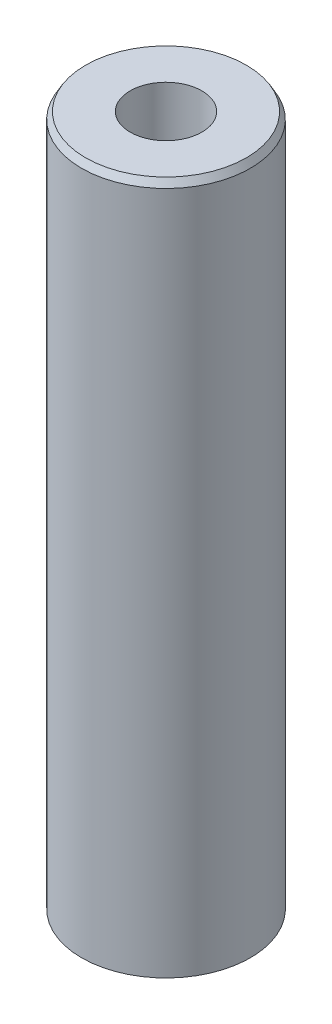
ISO-10303-21;
HEADER;
FILE_DESCRIPTION(('STEP AP214'),'2;1');
FILE_NAME('part.step','',(''),(''),'','','');
FILE_SCHEMA(('AUTOMOTIVE_DESIGN { 1 0 10303 214 1 1 1 1 }'));
ENDSEC;
DATA;
#1=APPLICATION_CONTEXT('core data for automotive mechanical design processes');
#2=APPLICATION_PROTOCOL_DEFINITION('international standard','automotive_design',2000,#1);
#3=PRODUCT_CONTEXT('',#1,'mechanical');
#4=PRODUCT('Part','Part','',(#3));
#5=PRODUCT_RELATED_PRODUCT_CATEGORY('part','',(#4));
#6=PRODUCT_DEFINITION_FORMATION('','',#4);
#7=PRODUCT_DEFINITION_CONTEXT('part definition',#1,'design');
#8=PRODUCT_DEFINITION('design','',#6,#7);
#9=PRODUCT_DEFINITION_SHAPE('','',#8);
#10=(LENGTH_UNIT() NAMED_UNIT(*) SI_UNIT(.MILLI.,.METRE.));
#11=(NAMED_UNIT(*) PLANE_ANGLE_UNIT() SI_UNIT($,.RADIAN.));
#12=(NAMED_UNIT(*) SI_UNIT($,.STERADIAN.) SOLID_ANGLE_UNIT());
#13=UNCERTAINTY_MEASURE_WITH_UNIT(LENGTH_MEASURE(1.E-05),#10,'distance_accuracy_value','');
#14=(GEOMETRIC_REPRESENTATION_CONTEXT(3) GLOBAL_UNCERTAINTY_ASSIGNED_CONTEXT((#13)) GLOBAL_UNIT_ASSIGNED_CONTEXT((#10,
#11,#12)) REPRESENTATION_CONTEXT('',''));
#15=CARTESIAN_POINT('',(0.,0.,0.));
#16=DIRECTION('',(0.,0.,1.));
#17=DIRECTION('',(1.,0.,0.));
#18=AXIS2_PLACEMENT_3D('',#15,#16,#17);
#19=CARTESIAN_POINT('',(0.,473.390255606188,0.));
#20=DIRECTION('',(0.,-1.,0.));
#21=DIRECTION('',(0.,0.,-1.));
#22=AXIS2_PLACEMENT_3D('',#19,#20,#21);
#23=CYLINDRICAL_SURFACE('',#22,57.5);
#24=CARTESIAN_POINT('',(0.,468.601018684927,0.));
#25=DIRECTION('',(0.,1.,0.));
#26=DIRECTION('',(0.,0.,1.));
#27=AXIS2_PLACEMENT_3D('',#24,#25,#26);
#28=CIRCLE('',#27,57.5);
#29=CARTESIAN_POINT('',(0.,468.601018684927,57.5));
#30=VERTEX_POINT('',#29);
#31=EDGE_CURVE('E50',#30,#30,#28,.F.);
#32=ORIENTED_EDGE('',*,*,#31,.T.);
#33=EDGE_LOOP('',(#32));
#34=FACE_BOUND('',#33,.T.);
#35=CARTESIAN_POINT('',(0.,2.76506722570274,0.));
#36=DIRECTION('',(0.,1.,0.));
#37=DIRECTION('',(0.,0.,1.));
#38=AXIS2_PLACEMENT_3D('',#35,#36,#37);
#39=CIRCLE('',#38,57.5);
#40=CARTESIAN_POINT('',(0.,2.76506722570274,57.5));
#41=VERTEX_POINT('',#40);
#42=EDGE_CURVE('E51',#41,#41,#39,.T.);
#43=ORIENTED_EDGE('',*,*,#42,.T.);
#44=EDGE_LOOP('',(#43));
#45=FACE_BOUND('',#44,.T.);
#46=ADVANCED_FACE('F39',(#34,#45),#23,.T.);
#47=CARTESIAN_POINT('',(0.,473.390255606188,0.));
#48=DIRECTION('',(0.,1.,0.));
#49=DIRECTION('',(0.,0.,1.));
#50=AXIS2_PLACEMENT_3D('',#47,#48,#49);
#51=PLANE('',#50);
#52=CARTESIAN_POINT('',(0.,473.390255606188,0.));
#53=DIRECTION('',(0.,1.,0.));
#54=DIRECTION('',(0.,0.,1.));
#55=AXIS2_PLACEMENT_3D('',#52,#53,#54);
#56=CIRCLE('',#55,54.7349327742972);
#57=CARTESIAN_POINT('',(0.,473.390255606188,54.7349327742972));
#58=VERTEX_POINT('',#57);
#59=EDGE_CURVE('E54',#58,#58,#56,.T.);
#60=ORIENTED_EDGE('',*,*,#59,.T.);
#61=EDGE_LOOP('',(#60));
#62=FACE_BOUND('',#61,.T.);
#63=CARTESIAN_POINT('',(0.,473.390255606188,0.));
#64=DIRECTION('',(0.,1.,0.));
#65=DIRECTION('',(0.,0.,1.));
#66=AXIS2_PLACEMENT_3D('',#63,#64,#65);
#67=CIRCLE('',#66,24.4230127451289);
#68=CARTESIAN_POINT('',(0.,473.390255606188,24.4230127451289));
#69=VERTEX_POINT('',#68);
#70=EDGE_CURVE('E58',#69,#69,#67,.T.);
#71=ORIENTED_EDGE('',*,*,#70,.F.);
#72=EDGE_LOOP('',(#71));
#73=FACE_BOUND('',#72,.T.);
#74=ADVANCED_FACE('F69',(#62,#73),#51,.T.);
#75=CARTESIAN_POINT('',(0.,0.,0.));
#76=DIRECTION('',(0.,1.,0.));
#77=DIRECTION('',(0.,0.,1.));
#78=AXIS2_PLACEMENT_3D('',#75,#76,#77);
#79=PLANE('',#78);
#80=CARTESIAN_POINT('',(0.,0.,0.));
#81=DIRECTION('',(0.,1.,0.));
#82=DIRECTION('',(0.,0.,1.));
#83=AXIS2_PLACEMENT_3D('',#80,#81,#82);
#84=CIRCLE('',#83,52.7107630787393);
#85=CARTESIAN_POINT('',(0.,0.,52.7107630787393));
#86=VERTEX_POINT('',#85);
#87=EDGE_CURVE('E10',#86,#86,#84,.F.);
#88=ORIENTED_EDGE('',*,*,#87,.T.);
#89=EDGE_LOOP('',(#88));
#90=FACE_BOUND('',#89,.T.);
#91=CARTESIAN_POINT('',(0.,0.,0.));
#92=DIRECTION('',(0.,1.,0.));
#93=DIRECTION('',(0.,0.,1.));
#94=AXIS2_PLACEMENT_3D('',#91,#92,#93);
#95=CIRCLE('',#94,24.4230127451289);
#96=CARTESIAN_POINT('',(0.,0.,24.4230127451289));
#97=VERTEX_POINT('',#96);
#98=EDGE_CURVE('E63',#97,#97,#95,.T.);
#99=ORIENTED_EDGE('',*,*,#98,.T.);
#100=EDGE_LOOP('',(#99));
#101=FACE_BOUND('',#100,.T.);
#102=ADVANCED_FACE('F75',(#90,#101),#79,.F.);
#103=CARTESIAN_POINT('',(0.,473.390255606188,0.));
#104=DIRECTION('',(0.,-1.,0.));
#105=DIRECTION('',(0.,0.,-1.));
#106=AXIS2_PLACEMENT_3D('',#103,#104,#105);
#107=CYLINDRICAL_SURFACE('',#106,24.4230127451289);
#108=ORIENTED_EDGE('',*,*,#70,.T.);
#109=EDGE_LOOP('',(#108));
#110=FACE_BOUND('',#109,.T.);
#111=ORIENTED_EDGE('',*,*,#98,.F.);
#112=EDGE_LOOP('',(#111));
#113=FACE_BOUND('',#112,.T.);
#114=ADVANCED_FACE('F70',(#110,#113),#107,.F.);
#115=CARTESIAN_POINT('',(0.,473.390255606188,0.));
#116=DIRECTION('',(0.,-1.,0.));
#117=DIRECTION('',(0.,0.,-1.));
#118=AXIS2_PLACEMENT_3D('',#115,#116,#117);
#119=CONICAL_SURFACE('',#118,54.7349327742972,0.523598775598295);
#120=ORIENTED_EDGE('',*,*,#31,.F.);
#121=EDGE_LOOP('',(#120));
#122=FACE_BOUND('',#121,.T.);
#123=ORIENTED_EDGE('',*,*,#59,.F.);
#124=EDGE_LOOP('',(#123));
#125=FACE_BOUND('',#124,.T.);
#126=ADVANCED_FACE('F81',(#122,#125),#119,.T.);
#127=CARTESIAN_POINT('',(0.,2.76506722570274,0.));
#128=DIRECTION('',(0.,1.,0.));
#129=DIRECTION('',(0.,0.,1.));
#130=AXIS2_PLACEMENT_3D('',#127,#128,#129);
#131=CONICAL_SURFACE('',#130,57.5,1.0471975511966);
#132=ORIENTED_EDGE('',*,*,#87,.F.);
#133=EDGE_LOOP('',(#132));
#134=FACE_BOUND('',#133,.T.);
#135=ORIENTED_EDGE('',*,*,#42,.F.);
#136=EDGE_LOOP('',(#135));
#137=FACE_BOUND('',#136,.T.);
#138=ADVANCED_FACE('F45',(#134,#137),#131,.T.);
#139=CLOSED_SHELL('',(#46,#74,#102,#114,#126,#138));
#140=MANIFOLD_SOLID_BREP('B2',#139);
#141=ADVANCED_BREP_SHAPE_REPRESENTATION('',(#18,#140),#14);
#142=SHAPE_DEFINITION_REPRESENTATION(#9,#141);
ENDSEC;
END-ISO-10303-21;
